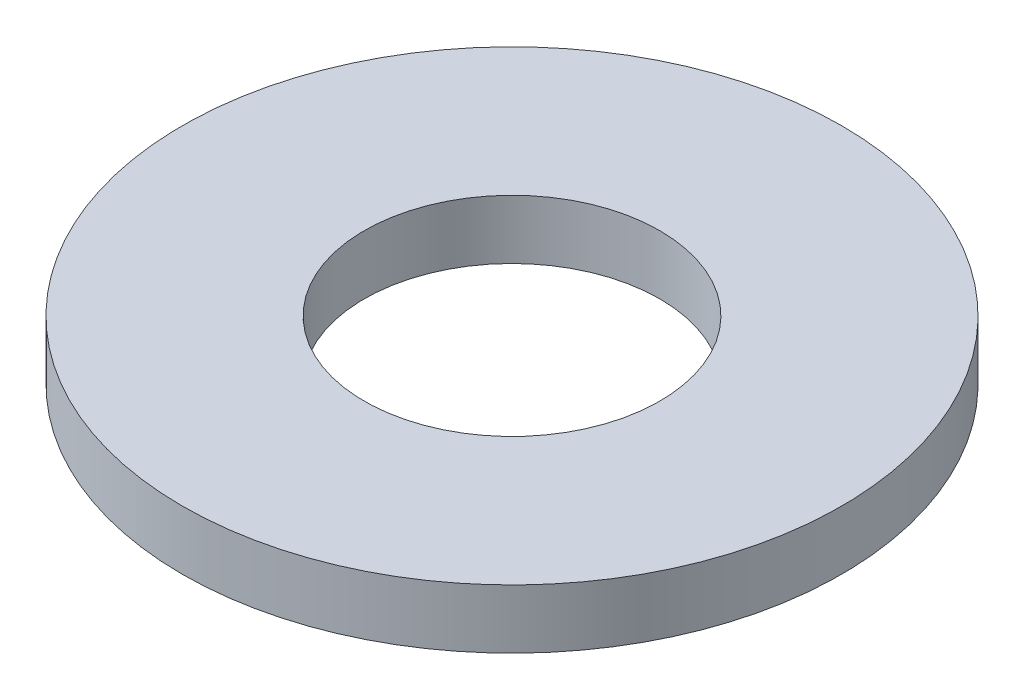
ISO-10303-21;
HEADER;
FILE_DESCRIPTION(('STEP AP214'),'2;1');
FILE_NAME('part.step','',(''),(''),'','','');
FILE_SCHEMA(('AUTOMOTIVE_DESIGN { 1 0 10303 214 1 1 1 1 }'));
ENDSEC;
DATA;
#1=APPLICATION_CONTEXT('core data for automotive mechanical design processes');
#2=APPLICATION_PROTOCOL_DEFINITION('international standard','automotive_design',2000,#1);
#3=PRODUCT_CONTEXT('',#1,'mechanical');
#4=PRODUCT('Part','Part','',(#3));
#5=PRODUCT_RELATED_PRODUCT_CATEGORY('part','',(#4));
#6=PRODUCT_DEFINITION_FORMATION('','',#4);
#7=PRODUCT_DEFINITION_CONTEXT('part definition',#1,'design');
#8=PRODUCT_DEFINITION('design','',#6,#7);
#9=PRODUCT_DEFINITION_SHAPE('','',#8);
#10=(LENGTH_UNIT() NAMED_UNIT(*) SI_UNIT(.MILLI.,.METRE.));
#11=(NAMED_UNIT(*) PLANE_ANGLE_UNIT() SI_UNIT($,.RADIAN.));
#12=(NAMED_UNIT(*) SI_UNIT($,.STERADIAN.) SOLID_ANGLE_UNIT());
#13=UNCERTAINTY_MEASURE_WITH_UNIT(LENGTH_MEASURE(1.E-05),#10,'distance_accuracy_value','');
#14=(GEOMETRIC_REPRESENTATION_CONTEXT(3) GLOBAL_UNCERTAINTY_ASSIGNED_CONTEXT((#13)) GLOBAL_UNIT_ASSIGNED_CONTEXT((#10,
#11,#12)) REPRESENTATION_CONTEXT('',''));
#15=CARTESIAN_POINT('',(0.,0.,0.));
#16=DIRECTION('',(0.,0.,1.));
#17=DIRECTION('',(1.,0.,0.));
#18=AXIS2_PLACEMENT_3D('',#15,#16,#17);
#19=CARTESIAN_POINT('',(0.,13.,0.));
#20=DIRECTION('',(0.,-1.,0.));
#21=DIRECTION('',(0.,0.,-1.));
#22=AXIS2_PLACEMENT_3D('',#19,#20,#21);
#23=CYLINDRICAL_SURFACE('',#22,72.5);
#24=CARTESIAN_POINT('',(0.,13.,0.));
#25=DIRECTION('',(0.,1.,0.));
#26=DIRECTION('',(0.,0.,1.));
#27=AXIS2_PLACEMENT_3D('',#24,#25,#26);
#28=CIRCLE('',#27,72.5);
#29=CARTESIAN_POINT('',(0.,13.,-72.5));
#30=VERTEX_POINT('',#29);
#31=EDGE_CURVE('E10',#30,#30,#28,.T.);
#32=CARTESIAN_POINT('',(0.,0.,0.));
#33=DIRECTION('',(0.,1.,0.));
#34=DIRECTION('',(0.,0.,1.));
#35=AXIS2_PLACEMENT_3D('',#32,#33,#34);
#36=CIRCLE('',#35,72.5);
#37=CARTESIAN_POINT('',(0.,0.,-72.5));
#38=VERTEX_POINT('',#37);
#39=EDGE_CURVE('E37',#38,#38,#36,.T.);
#40=CARTESIAN_POINT('',(0.,13.,-72.5));
#41=CARTESIAN_POINT('',(0.,12.8645833333333,-72.5));
#42=CARTESIAN_POINT('',(0.,12.7291666666667,-72.5));
#43=CARTESIAN_POINT('',(0.,12.4583333333333,-72.5));
#44=CARTESIAN_POINT('',(0.,12.3229166666667,-72.5));
#45=CARTESIAN_POINT('',(0.,12.0520833333333,-72.5));
#46=CARTESIAN_POINT('',(0.,11.9166666666667,-72.5));
#47=CARTESIAN_POINT('',(0.,11.6458333333333,-72.5));
#48=CARTESIAN_POINT('',(0.,11.5104166666667,-72.5));
#49=CARTESIAN_POINT('',(0.,11.2395833333333,-72.5));
#50=CARTESIAN_POINT('',(0.,11.1041666666667,-72.5));
#51=CARTESIAN_POINT('',(0.,10.8333333333333,-72.5));
#52=CARTESIAN_POINT('',(0.,10.6979166666667,-72.5));
#53=CARTESIAN_POINT('',(0.,10.4270833333333,-72.5));
#54=CARTESIAN_POINT('',(0.,10.2916666666667,-72.5));
#55=CARTESIAN_POINT('',(0.,10.0208333333333,-72.5));
#56=CARTESIAN_POINT('',(0.,9.88541666666667,-72.5));
#57=CARTESIAN_POINT('',(0.,9.61458333333333,-72.5));
#58=CARTESIAN_POINT('',(0.,9.47916666666667,-72.5));
#59=CARTESIAN_POINT('',(0.,9.20833333333333,-72.5));
#60=CARTESIAN_POINT('',(0.,9.07291666666666,-72.5));
#61=CARTESIAN_POINT('',(0.,8.80208333333333,-72.5));
#62=CARTESIAN_POINT('',(0.,8.66666666666667,-72.5));
#63=CARTESIAN_POINT('',(0.,8.39583333333333,-72.5));
#64=CARTESIAN_POINT('',(0.,8.26041666666667,-72.5));
#65=CARTESIAN_POINT('',(0.,7.98958333333333,-72.5));
#66=CARTESIAN_POINT('',(0.,7.85416666666667,-72.5));
#67=CARTESIAN_POINT('',(0.,7.58333333333333,-72.5));
#68=CARTESIAN_POINT('',(0.,7.44791666666667,-72.5));
#69=CARTESIAN_POINT('',(0.,7.17708333333333,-72.5));
#70=CARTESIAN_POINT('',(0.,7.04166666666667,-72.5));
#71=CARTESIAN_POINT('',(0.,6.77083333333333,-72.5));
#72=CARTESIAN_POINT('',(0.,6.63541666666667,-72.5));
#73=CARTESIAN_POINT('',(0.,6.36458333333333,-72.5));
#74=CARTESIAN_POINT('',(0.,6.22916666666667,-72.5));
#75=CARTESIAN_POINT('',(0.,5.95833333333333,-72.5));
#76=CARTESIAN_POINT('',(0.,5.82291666666667,-72.5));
#77=CARTESIAN_POINT('',(0.,5.55208333333333,-72.5));
#78=CARTESIAN_POINT('',(0.,5.41666666666667,-72.5));
#79=CARTESIAN_POINT('',(0.,5.14583333333333,-72.5));
#80=CARTESIAN_POINT('',(0.,5.01041666666667,-72.5));
#81=CARTESIAN_POINT('',(0.,4.73958333333333,-72.5));
#82=CARTESIAN_POINT('',(0.,4.60416666666667,-72.5));
#83=CARTESIAN_POINT('',(0.,4.33333333333333,-72.5));
#84=CARTESIAN_POINT('',(0.,4.19791666666667,-72.5));
#85=CARTESIAN_POINT('',(0.,3.92708333333333,-72.5));
#86=CARTESIAN_POINT('',(0.,3.79166666666667,-72.5));
#87=CARTESIAN_POINT('',(0.,3.52083333333333,-72.5));
#88=CARTESIAN_POINT('',(0.,3.38541666666667,-72.5));
#89=CARTESIAN_POINT('',(0.,3.11458333333333,-72.5));
#90=CARTESIAN_POINT('',(0.,2.97916666666667,-72.5));
#91=CARTESIAN_POINT('',(0.,2.70833333333333,-72.5));
#92=CARTESIAN_POINT('',(0.,2.57291666666667,-72.5));
#93=CARTESIAN_POINT('',(0.,2.30208333333333,-72.5));
#94=CARTESIAN_POINT('',(0.,2.16666666666667,-72.5));
#95=CARTESIAN_POINT('',(0.,1.89583333333333,-72.5));
#96=CARTESIAN_POINT('',(0.,1.76041666666667,-72.5));
#97=CARTESIAN_POINT('',(0.,1.48958333333333,-72.5));
#98=CARTESIAN_POINT('',(0.,1.35416666666667,-72.5));
#99=CARTESIAN_POINT('',(0.,1.08333333333333,-72.5));
#100=CARTESIAN_POINT('',(0.,0.947916666666667,-72.5));
#101=CARTESIAN_POINT('',(0.,0.677083333333334,-72.5));
#102=CARTESIAN_POINT('',(0.,0.541666666666667,-72.5));
#103=CARTESIAN_POINT('',(0.,0.270833333333334,-72.5));
#104=CARTESIAN_POINT('',(0.,0.135416666666667,-72.5));
#105=CARTESIAN_POINT('',(0.,0.,-72.5));
#106=B_SPLINE_CURVE_WITH_KNOTS('',3,(#40,#41,#42,#43,#44,#45,#46,#47,#48,#49,#50,#51,#52,#53,
#54,#55,#56,#57,#58,#59,#60,#61,#62,#63,#64,#65,#66,#67,#68,#69,#70,#71,#72,#73,#74,#75,#76,#77,
#78,#79,#80,#81,#82,#83,#84,#85,#86,#87,#88,#89,#90,#91,#92,#93,#94,#95,#96,#97,#98,#99,#100,
#101,#102,#103,#104,#105),.UNSPECIFIED.,.F.,.F.,(4,2,2,2,2,2,2,2,2,2,2,2,2,2,2,2,2,2,2,2,2,2,2,
2,2,2,2,2,2,2,2,2,4),(0.,0.40625,0.812500000000001,1.21875,1.625,2.03125,2.4375,2.84375,3.25,
3.65625,4.0625,4.46875,4.875,5.28125,5.6875,6.09375,6.5,6.90625,7.3125,7.71875,8.125,8.53125,
8.9375,9.34375,9.75,10.15625,10.5625,10.96875,11.375,11.78125,12.1875,12.59375,13.),.UNSPECIFIED.);
#107=EDGE_CURVE('BSEAM40',#30,#38,#106,.T.);
#108=ORIENTED_EDGE('',*,*,#31,.F.);
#109=ORIENTED_EDGE('',*,*,#39,.T.);
#110=ORIENTED_EDGE('',*,*,#107,.T.);
#111=ORIENTED_EDGE('',*,*,#107,.F.);
#112=EDGE_LOOP('',(#108,#110,#109,#111));
#113=FACE_BOUND('',#112,.T.);
#114=ADVANCED_FACE('F40',(#113),#23,.T.);
#115=CARTESIAN_POINT('',(0.,13.,0.));
#116=DIRECTION('',(0.,1.,0.));
#117=DIRECTION('',(0.,0.,1.));
#118=AXIS2_PLACEMENT_3D('',#115,#116,#117);
#119=PLANE('',#118);
#120=CARTESIAN_POINT('',(0.,13.,0.));
#121=DIRECTION('',(0.,1.,0.));
#122=DIRECTION('',(0.,0.,1.));
#123=AXIS2_PLACEMENT_3D('',#120,#121,#122);
#124=CIRCLE('',#123,32.5);
#125=CARTESIAN_POINT('',(0.,13.,-32.5));
#126=VERTEX_POINT('',#125);
#127=EDGE_CURVE('E50',#126,#126,#124,.T.);
#128=ORIENTED_EDGE('',*,*,#127,.F.);
#129=EDGE_LOOP('',(#128));
#130=FACE_BOUND('',#129,.T.);
#131=ORIENTED_EDGE('',*,*,#31,.T.);
#132=EDGE_LOOP('',(#131));
#133=FACE_BOUND('',#132,.T.);
#134=ADVANCED_FACE('F59',(#130,#133),#119,.T.);
#135=CARTESIAN_POINT('',(0.,0.,0.));
#136=DIRECTION('',(0.,1.,0.));
#137=DIRECTION('',(0.,0.,1.));
#138=AXIS2_PLACEMENT_3D('',#135,#136,#137);
#139=PLANE('',#138);
#140=CARTESIAN_POINT('',(0.,0.,0.));
#141=DIRECTION('',(0.,1.,0.));
#142=DIRECTION('',(0.,0.,1.));
#143=AXIS2_PLACEMENT_3D('',#140,#141,#142);
#144=CIRCLE('',#143,32.5);
#145=CARTESIAN_POINT('',(0.,0.,-32.5));
#146=VERTEX_POINT('',#145);
#147=EDGE_CURVE('E47',#146,#146,#144,.T.);
#148=ORIENTED_EDGE('',*,*,#147,.T.);
#149=EDGE_LOOP('',(#148));
#150=FACE_BOUND('',#149,.T.);
#151=ORIENTED_EDGE('',*,*,#39,.F.);
#152=EDGE_LOOP('',(#151));
#153=FACE_BOUND('',#152,.T.);
#154=ADVANCED_FACE('F58',(#150,#153),#139,.F.);
#155=CARTESIAN_POINT('',(0.,13.,0.));
#156=DIRECTION('',(0.,-1.,0.));
#157=DIRECTION('',(0.,0.,-1.));
#158=AXIS2_PLACEMENT_3D('',#155,#156,#157);
#159=CYLINDRICAL_SURFACE('',#158,32.5);
#160=CARTESIAN_POINT('',(0.,13.,-32.5));
#161=CARTESIAN_POINT('',(0.,12.8645833333333,-32.5));
#162=CARTESIAN_POINT('',(0.,12.7291666666667,-32.5));
#163=CARTESIAN_POINT('',(0.,12.4583333333333,-32.5));
#164=CARTESIAN_POINT('',(0.,12.3229166666667,-32.5));
#165=CARTESIAN_POINT('',(0.,12.0520833333333,-32.5));
#166=CARTESIAN_POINT('',(0.,11.9166666666667,-32.5));
#167=CARTESIAN_POINT('',(0.,11.6458333333333,-32.5));
#168=CARTESIAN_POINT('',(0.,11.5104166666667,-32.5));
#169=CARTESIAN_POINT('',(0.,11.2395833333333,-32.5));
#170=CARTESIAN_POINT('',(0.,11.1041666666667,-32.5));
#171=CARTESIAN_POINT('',(0.,10.8333333333333,-32.5));
#172=CARTESIAN_POINT('',(0.,10.6979166666667,-32.5));
#173=CARTESIAN_POINT('',(0.,10.4270833333333,-32.5));
#174=CARTESIAN_POINT('',(0.,10.2916666666667,-32.5));
#175=CARTESIAN_POINT('',(0.,10.0208333333333,-32.5));
#176=CARTESIAN_POINT('',(0.,9.88541666666667,-32.5));
#177=CARTESIAN_POINT('',(0.,9.61458333333333,-32.5));
#178=CARTESIAN_POINT('',(0.,9.47916666666667,-32.5));
#179=CARTESIAN_POINT('',(0.,9.20833333333333,-32.5));
#180=CARTESIAN_POINT('',(0.,9.07291666666667,-32.5));
#181=CARTESIAN_POINT('',(0.,8.80208333333333,-32.5));
#182=CARTESIAN_POINT('',(0.,8.66666666666667,-32.5));
#183=CARTESIAN_POINT('',(0.,8.39583333333333,-32.5));
#184=CARTESIAN_POINT('',(0.,8.26041666666667,-32.5));
#185=CARTESIAN_POINT('',(0.,7.98958333333333,-32.5));
#186=CARTESIAN_POINT('',(0.,7.85416666666667,-32.5));
#187=CARTESIAN_POINT('',(0.,7.58333333333333,-32.5));
#188=CARTESIAN_POINT('',(0.,7.44791666666667,-32.5));
#189=CARTESIAN_POINT('',(0.,7.17708333333333,-32.5));
#190=CARTESIAN_POINT('',(0.,7.04166666666667,-32.5));
#191=CARTESIAN_POINT('',(0.,6.77083333333333,-32.5));
#192=CARTESIAN_POINT('',(0.,6.63541666666667,-32.5));
#193=CARTESIAN_POINT('',(0.,6.36458333333333,-32.5));
#194=CARTESIAN_POINT('',(0.,6.22916666666667,-32.5));
#195=CARTESIAN_POINT('',(0.,5.95833333333333,-32.5));
#196=CARTESIAN_POINT('',(0.,5.82291666666667,-32.5));
#197=CARTESIAN_POINT('',(0.,5.55208333333333,-32.5));
#198=CARTESIAN_POINT('',(0.,5.41666666666667,-32.5));
#199=CARTESIAN_POINT('',(0.,5.14583333333333,-32.5));
#200=CARTESIAN_POINT('',(0.,5.01041666666667,-32.5));
#201=CARTESIAN_POINT('',(0.,4.73958333333333,-32.5));
#202=CARTESIAN_POINT('',(0.,4.60416666666667,-32.5));
#203=CARTESIAN_POINT('',(0.,4.33333333333333,-32.5));
#204=CARTESIAN_POINT('',(0.,4.19791666666667,-32.5));
#205=CARTESIAN_POINT('',(0.,3.92708333333333,-32.5));
#206=CARTESIAN_POINT('',(0.,3.79166666666667,-32.5));
#207=CARTESIAN_POINT('',(0.,3.52083333333333,-32.5));
#208=CARTESIAN_POINT('',(0.,3.38541666666667,-32.5));
#209=CARTESIAN_POINT('',(0.,3.11458333333333,-32.5));
#210=CARTESIAN_POINT('',(0.,2.97916666666667,-32.5));
#211=CARTESIAN_POINT('',(0.,2.70833333333333,-32.5));
#212=CARTESIAN_POINT('',(0.,2.57291666666667,-32.5));
#213=CARTESIAN_POINT('',(0.,2.30208333333333,-32.5));
#214=CARTESIAN_POINT('',(0.,2.16666666666667,-32.5));
#215=CARTESIAN_POINT('',(0.,1.89583333333333,-32.5));
#216=CARTESIAN_POINT('',(0.,1.76041666666667,-32.5));
#217=CARTESIAN_POINT('',(0.,1.48958333333333,-32.5));
#218=CARTESIAN_POINT('',(0.,1.35416666666667,-32.5));
#219=CARTESIAN_POINT('',(0.,1.08333333333333,-32.5));
#220=CARTESIAN_POINT('',(0.,0.947916666666667,-32.5));
#221=CARTESIAN_POINT('',(0.,0.677083333333334,-32.5));
#222=CARTESIAN_POINT('',(0.,0.541666666666667,-32.5));
#223=CARTESIAN_POINT('',(0.,0.270833333333334,-32.5));
#224=CARTESIAN_POINT('',(0.,0.135416666666667,-32.5));
#225=CARTESIAN_POINT('',(0.,0.,-32.5));
#226=B_SPLINE_CURVE_WITH_KNOTS('',3,(#160,#161,#162,#163,#164,#165,#166,#167,#168,#169,#170,
#171,#172,#173,#174,#175,#176,#177,#178,#179,#180,#181,#182,#183,#184,#185,#186,#187,#188,#189,
#190,#191,#192,#193,#194,#195,#196,#197,#198,#199,#200,#201,#202,#203,#204,#205,#206,#207,#208,
#209,#210,#211,#212,#213,#214,#215,#216,#217,#218,#219,#220,#221,#222,#223,#224,#225),
.UNSPECIFIED.,.F.,.F.,(4,2,2,2,2,2,2,2,2,2,2,2,2,2,2,2,2,2,2,2,2,2,2,2,2,2,2,2,2,2,2,2,4),(0.,
0.406249999999999,0.812499999999999,1.21875,1.625,2.03125,2.4375,2.84375,3.25,3.65625,4.0625,
4.46875,4.875,5.28125,5.6875,6.09375,6.5,6.90625,7.3125,7.71875,8.125,8.53125,8.9375,9.34375,
9.75,10.15625,10.5625,10.96875,11.375,11.78125,12.1875,12.59375,13.),.UNSPECIFIED.);
#227=EDGE_CURVE('BSEAM54',#126,#146,#226,.T.);
#228=ORIENTED_EDGE('',*,*,#127,.T.);
#229=ORIENTED_EDGE('',*,*,#147,.F.);
#230=ORIENTED_EDGE('',*,*,#227,.T.);
#231=ORIENTED_EDGE('',*,*,#227,.F.);
#232=EDGE_LOOP('',(#228,#230,#229,#231));
#233=FACE_BOUND('',#232,.T.);
#234=ADVANCED_FACE('F54',(#233),#159,.F.);
#235=CLOSED_SHELL('',(#114,#134,#154,#234));
#236=MANIFOLD_SOLID_BREP('B2',#235);
#237=ADVANCED_BREP_SHAPE_REPRESENTATION('',(#18,#236),#14);
#238=SHAPE_DEFINITION_REPRESENTATION(#9,#237);
ENDSEC;
END-ISO-10303-21;
